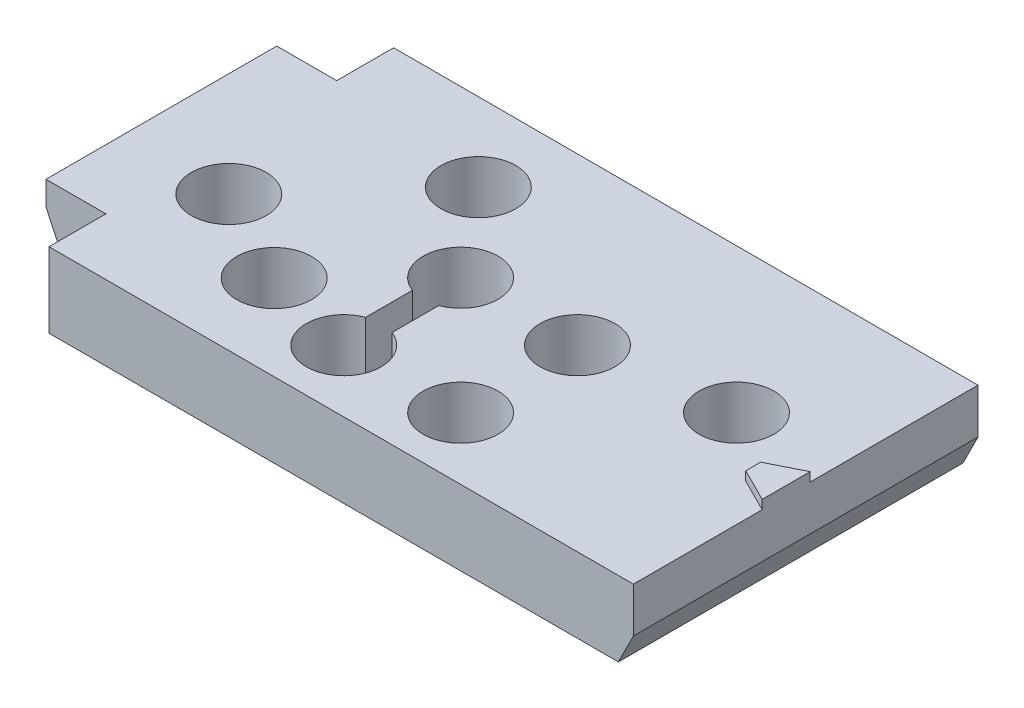
ISO-10303-21;
HEADER;
FILE_DESCRIPTION(('STEP AP214'),'2;1');
FILE_NAME('part.step','',(''),(''),'','','');
FILE_SCHEMA(('AUTOMOTIVE_DESIGN { 1 0 10303 214 1 1 1 1 }'));
ENDSEC;
DATA;
#1=APPLICATION_CONTEXT('core data for automotive mechanical design processes');
#2=APPLICATION_PROTOCOL_DEFINITION('international standard','automotive_design',2000,#1);
#3=PRODUCT_CONTEXT('',#1,'mechanical');
#4=PRODUCT('Part','Part','',(#3));
#5=PRODUCT_RELATED_PRODUCT_CATEGORY('part','',(#4));
#6=PRODUCT_DEFINITION_FORMATION('','',#4);
#7=PRODUCT_DEFINITION_CONTEXT('part definition',#1,'design');
#8=PRODUCT_DEFINITION('design','',#6,#7);
#9=PRODUCT_DEFINITION_SHAPE('','',#8);
#10=(LENGTH_UNIT() NAMED_UNIT(*) SI_UNIT(.MILLI.,.METRE.));
#11=(NAMED_UNIT(*) PLANE_ANGLE_UNIT() SI_UNIT($,.RADIAN.));
#12=(NAMED_UNIT(*) SI_UNIT($,.STERADIAN.) SOLID_ANGLE_UNIT());
#13=UNCERTAINTY_MEASURE_WITH_UNIT(LENGTH_MEASURE(1.E-05),#10,'distance_accuracy_value','');
#14=(GEOMETRIC_REPRESENTATION_CONTEXT(3) GLOBAL_UNCERTAINTY_ASSIGNED_CONTEXT((#13)) GLOBAL_UNIT_ASSIGNED_CONTEXT((#10,
#11,#12)) REPRESENTATION_CONTEXT('',''));
#15=CARTESIAN_POINT('',(0.,0.,0.));
#16=DIRECTION('',(0.,0.,1.));
#17=DIRECTION('',(1.,0.,0.));
#18=AXIS2_PLACEMENT_3D('',#15,#16,#17);
#19=CARTESIAN_POINT('',(23.2390769716936,-6.35,-43.157166812339));
#20=DIRECTION('',(-1.,0.,0.));
#21=DIRECTION('',(0.,0.,1.));
#22=AXIS2_PLACEMENT_3D('',#19,#20,#21);
#23=PLANE('',#22);
#24=DIRECTION('',(0.,0.,1.));
#25=VECTOR('',#24,1.);
#26=CARTESIAN_POINT('',(23.2390769716936,-2.032,-47.983306812339));
#27=LINE('',#26,#25);
#28=CARTESIAN_POINT('',(23.2390769716936,-2.032,-43.157166812339));
#29=VERTEX_POINT('',#28);
#30=CARTESIAN_POINT('',(23.2390769716936,-2.032,-23.599166812339));
#31=VERTEX_POINT('',#30);
#32=EDGE_CURVE('E167',#29,#31,#27,.T.);
#33=ORIENTED_EDGE('',*,*,#32,.T.);
#34=DIRECTION('',(0.,1.,0.));
#35=VECTOR('',#34,1.);
#36=CARTESIAN_POINT('',(23.2390769716936,-6.35,-23.599166812339));
#37=LINE('',#36,#35);
#38=CARTESIAN_POINT('',(23.2390769716936,0.,-23.599166812339));
#39=VERTEX_POINT('',#38);
#40=EDGE_CURVE('E166',#31,#39,#37,.T.);
#41=ORIENTED_EDGE('',*,*,#40,.T.);
#42=DIRECTION('',(0.,0.,1.));
#43=VECTOR('',#42,1.);
#44=CARTESIAN_POINT('',(23.2390769716936,0.,-43.157166812339));
#45=LINE('',#44,#43);
#46=CARTESIAN_POINT('',(23.2390769716936,0.,-43.157166812339));
#47=VERTEX_POINT('',#46);
#48=EDGE_CURVE('E192',#47,#39,#45,.T.);
#49=ORIENTED_EDGE('',*,*,#48,.F.);
#50=DIRECTION('',(0.,1.,0.));
#51=VECTOR('',#50,1.);
#52=CARTESIAN_POINT('',(23.2390769716936,-6.35,-43.157166812339));
#53=LINE('',#52,#51);
#54=EDGE_CURVE('E385',#29,#47,#53,.T.);
#55=ORIENTED_EDGE('',*,*,#54,.F.);
#56=EDGE_LOOP('',(#33,#41,#49,#55));
#57=FACE_BOUND('',#56,.T.);
#58=ADVANCED_FACE('F33',(#57),#23,.T.);
#59=CARTESIAN_POINT('',(23.2390769716936,-6.35,-43.157166812339));
#60=DIRECTION('',(0.,0.,1.));
#61=DIRECTION('',(1.,0.,0.));
#62=AXIS2_PLACEMENT_3D('',#59,#60,#61);
#63=PLANE('',#62);
#64=DIRECTION('',(1.,0.,0.));
#65=VECTOR('',#64,1.);
#66=CARTESIAN_POINT('',(23.2390769716936,-6.35,-43.157166812339));
#67=LINE('',#66,#65);
#68=CARTESIAN_POINT('',(25.2710769716936,-6.35,-43.157166812339));
#69=VERTEX_POINT('',#68);
#70=CARTESIAN_POINT('',(28.3190769716936,-6.35,-43.157166812339));
#71=VERTEX_POINT('',#70);
#72=EDGE_CURVE('E190',#69,#71,#67,.T.);
#73=ORIENTED_EDGE('',*,*,#72,.F.);
#74=DIRECTION('',(-0.425797036329879,0.904818702200994,0.));
#75=VECTOR('',#74,1.);
#76=CARTESIAN_POINT('',(24.9026690396823,-5.56713314447592,-43.157166812339));
#77=LINE('',#76,#75);
#78=EDGE_CURVE('E47',#69,#29,#77,.T.);
#79=ORIENTED_EDGE('',*,*,#78,.T.);
#80=ORIENTED_EDGE('',*,*,#54,.T.);
#81=DIRECTION('',(1.,0.,0.));
#82=VECTOR('',#81,1.);
#83=CARTESIAN_POINT('',(23.2390769716936,0.,-43.157166812339));
#84=LINE('',#83,#82);
#85=CARTESIAN_POINT('',(28.3190769716936,0.,-43.157166812339));
#86=VERTEX_POINT('',#85);
#87=EDGE_CURVE('E173',#47,#86,#84,.T.);
#88=ORIENTED_EDGE('',*,*,#87,.T.);
#89=DIRECTION('',(0.,1.,0.));
#90=VECTOR('',#89,1.);
#91=CARTESIAN_POINT('',(28.3190769716936,-6.35,-43.157166812339));
#92=LINE('',#91,#90);
#93=EDGE_CURVE('E413',#71,#86,#92,.T.);
#94=ORIENTED_EDGE('',*,*,#93,.F.);
#95=EDGE_LOOP('',(#73,#79,#80,#88,#94));
#96=FACE_BOUND('',#95,.T.);
#97=ADVANCED_FACE('F374',(#96),#63,.F.);
#98=CARTESIAN_POINT('',(28.3190769716936,-6.35,-47.983166812339));
#99=DIRECTION('',(-1.,0.,0.));
#100=DIRECTION('',(0.,0.,1.));
#101=AXIS2_PLACEMENT_3D('',#98,#99,#100);
#102=PLANE('',#101);
#103=DIRECTION('',(0.,0.,1.));
#104=VECTOR('',#103,1.);
#105=CARTESIAN_POINT('',(28.3190769716936,0.,-47.983166812339));
#106=LINE('',#105,#104);
#107=CARTESIAN_POINT('',(28.3190769716936,0.,-47.983166812339));
#108=VERTEX_POINT('',#107);
#109=EDGE_CURVE('E178',#108,#86,#106,.T.);
#110=ORIENTED_EDGE('',*,*,#109,.F.);
#111=DIRECTION('',(0.,1.,0.));
#112=VECTOR('',#111,1.);
#113=CARTESIAN_POINT('',(28.3190769716936,-6.35,-47.983166812339));
#114=LINE('',#113,#112);
#115=CARTESIAN_POINT('',(28.3190769716936,-6.35,-47.983166812339));
#116=VERTEX_POINT('',#115);
#117=EDGE_CURVE('E227',#116,#108,#114,.T.);
#118=ORIENTED_EDGE('',*,*,#117,.F.);
#119=DIRECTION('',(0.,0.,1.));
#120=VECTOR('',#119,1.);
#121=CARTESIAN_POINT('',(28.3190769716936,-6.35,-47.983166812339));
#122=LINE('',#121,#120);
#123=EDGE_CURVE('E187',#116,#71,#122,.T.);
#124=ORIENTED_EDGE('',*,*,#123,.T.);
#125=ORIENTED_EDGE('',*,*,#93,.T.);
#126=EDGE_LOOP('',(#110,#118,#124,#125));
#127=FACE_BOUND('',#126,.T.);
#128=ADVANCED_FACE('F380',(#127),#102,.T.);
#129=CARTESIAN_POINT('',(77.8490769716936,-6.35,-47.983166812339));
#130=DIRECTION('',(0.,0.,-1.));
#131=DIRECTION('',(-1.,0.,0.));
#132=AXIS2_PLACEMENT_3D('',#129,#130,#131);
#133=PLANE('',#132);
#134=DIRECTION('',(0.447213595499956,0.894427190999917,0.));
#135=VECTOR('',#134,1.);
#136=CARTESIAN_POINT('',(76.8330769716936,-5.84200000000001,-47.983166812339));
#137=LINE('',#136,#135);
#138=CARTESIAN_POINT('',(76.5790769716936,-6.35,-47.983166812339));
#139=VERTEX_POINT('',#138);
#140=CARTESIAN_POINT('',(77.8490769716936,-3.81000000000001,-47.983169312339));
#141=VERTEX_POINT('',#140);
#142=EDGE_CURVE('E234',#139,#141,#137,.T.);
#143=ORIENTED_EDGE('',*,*,#142,.F.);
#144=DIRECTION('',(-1.,0.,0.));
#145=VECTOR('',#144,1.);
#146=CARTESIAN_POINT('',(77.8490769716936,-6.35,-47.983166812339));
#147=LINE('',#146,#145);
#148=EDGE_CURVE('E185',#139,#116,#147,.T.);
#149=ORIENTED_EDGE('',*,*,#148,.T.);
#150=ORIENTED_EDGE('',*,*,#117,.T.);
#151=DIRECTION('',(-1.,0.,0.));
#152=VECTOR('',#151,1.);
#153=CARTESIAN_POINT('',(77.8490769716936,0.,-47.983166812339));
#154=LINE('',#153,#152);
#155=CARTESIAN_POINT('',(77.8490769716936,0.,-47.983166812339));
#156=VERTEX_POINT('',#155);
#157=EDGE_CURVE('E208',#156,#108,#154,.T.);
#158=ORIENTED_EDGE('',*,*,#157,.F.);
#159=DIRECTION('',(0.,1.,0.));
#160=VECTOR('',#159,1.);
#161=CARTESIAN_POINT('',(77.8490769716936,-6.35,-47.983166812339));
#162=LINE('',#161,#160);
#163=EDGE_CURVE('E224',#141,#156,#162,.T.);
#164=ORIENTED_EDGE('',*,*,#163,.F.);
#165=EDGE_LOOP('',(#143,#149,#150,#158,#164));
#166=FACE_BOUND('',#165,.T.);
#167=ADVANCED_FACE('F418',(#166),#133,.T.);
#168=CARTESIAN_POINT('',(77.8490769716936,-6.35,-47.983166812339));
#169=DIRECTION('',(-1.,0.,0.));
#170=DIRECTION('',(0.,0.,1.));
#171=AXIS2_PLACEMENT_3D('',#168,#169,#170);
#172=PLANE('',#171);
#173=DIRECTION('',(0.,1.,0.));
#174=VECTOR('',#173,1.);
#175=CARTESIAN_POINT('',(77.8490769716936,-6.35,-18.773166812339));
#176=LINE('',#175,#174);
#177=CARTESIAN_POINT('',(77.8490769716936,-3.81,-18.773166812339));
#178=VERTEX_POINT('',#177);
#179=CARTESIAN_POINT('',(77.8490769716936,0.,-18.773166812339));
#180=VERTEX_POINT('',#179);
#181=EDGE_CURVE('E222',#178,#180,#176,.T.);
#182=ORIENTED_EDGE('',*,*,#181,.F.);
#183=DIRECTION('',(0.,0.,1.));
#184=VECTOR('',#183,1.);
#185=CARTESIAN_POINT('',(77.8490769716936,-3.81,-47.983191812339));
#186=LINE('',#185,#184);
#187=EDGE_CURVE('E238',#141,#178,#186,.T.);
#188=ORIENTED_EDGE('',*,*,#187,.F.);
#189=ORIENTED_EDGE('',*,*,#163,.T.);
#190=DIRECTION('',(0.,0.,1.));
#191=VECTOR('',#190,1.);
#192=CARTESIAN_POINT('',(77.8490769716936,0.,-47.983166812339));
#193=LINE('',#192,#191);
#194=CARTESIAN_POINT('',(77.8490769716936,0.,-33.759166812339));
#195=VERTEX_POINT('',#194);
#196=EDGE_CURVE('E214',#156,#195,#193,.T.);
#197=ORIENTED_EDGE('',*,*,#196,.T.);
#198=DIRECTION('',(0.,-1.,0.));
#199=VECTOR('',#198,1.);
#200=CARTESIAN_POINT('',(77.8490769716936,0.762,-33.759166812339));
#201=LINE('',#200,#199);
#202=CARTESIAN_POINT('',(77.8490769716936,0.762,-33.759166812339));
#203=VERTEX_POINT('',#202);
#204=EDGE_CURVE('E749',#203,#195,#201,.T.);
#205=ORIENTED_EDGE('',*,*,#204,.F.);
#206=DIRECTION('',(0.,0.,-1.));
#207=VECTOR('',#206,1.);
#208=CARTESIAN_POINT('',(77.8490769716936,0.762,-33.759166812339));
#209=LINE('',#208,#207);
#210=CARTESIAN_POINT('',(77.8490769716936,0.762,-29.695166812339));
#211=VERTEX_POINT('',#210);
#212=EDGE_CURVE('E248',#211,#203,#209,.T.);
#213=ORIENTED_EDGE('',*,*,#212,.F.);
#214=DIRECTION('',(0.,-1.,0.));
#215=VECTOR('',#214,1.);
#216=CARTESIAN_POINT('',(77.8490769716936,0.762,-29.695166812339));
#217=LINE('',#216,#215);
#218=CARTESIAN_POINT('',(77.8490769716936,0.,-29.695166812339));
#219=VERTEX_POINT('',#218);
#220=EDGE_CURVE('E258',#211,#219,#217,.T.);
#221=ORIENTED_EDGE('',*,*,#220,.T.);
#222=EDGE_CURVE('E205',#219,#180,#193,.T.);
#223=ORIENTED_EDGE('',*,*,#222,.T.);
#224=EDGE_LOOP('',(#182,#188,#189,#197,#205,#213,#221,#223));
#225=FACE_BOUND('',#224,.T.);
#226=ADVANCED_FACE('F400',(#225),#172,.F.);
#227=CARTESIAN_POINT('',(77.8490769716936,-6.35,-18.773166812339));
#228=DIRECTION('',(0.,0.,-1.));
#229=DIRECTION('',(-1.,0.,0.));
#230=AXIS2_PLACEMENT_3D('',#227,#228,#229);
#231=PLANE('',#230);
#232=DIRECTION('',(-1.,0.,0.));
#233=VECTOR('',#232,1.);
#234=CARTESIAN_POINT('',(77.8490769716936,-6.35,-18.773166812339));
#235=LINE('',#234,#233);
#236=CARTESIAN_POINT('',(76.5790769716936,-6.35,-18.773166812339));
#237=VERTEX_POINT('',#236);
#238=CARTESIAN_POINT('',(28.3190769716936,-6.35,-18.773166812339));
#239=VERTEX_POINT('',#238);
#240=EDGE_CURVE('E175',#237,#239,#235,.T.);
#241=ORIENTED_EDGE('',*,*,#240,.F.);
#242=DIRECTION('',(-0.447213595499956,-0.894427190999917,0.));
#243=VECTOR('',#242,1.);
#244=CARTESIAN_POINT('',(77.8490769716936,-3.81,-18.773166812339));
#245=LINE('',#244,#243);
#246=EDGE_CURVE('E54',#178,#237,#245,.T.);
#247=ORIENTED_EDGE('',*,*,#246,.F.);
#248=ORIENTED_EDGE('',*,*,#181,.T.);
#249=DIRECTION('',(-1.,0.,0.));
#250=VECTOR('',#249,1.);
#251=CARTESIAN_POINT('',(77.8490769716936,0.,-18.773166812339));
#252=LINE('',#251,#250);
#253=CARTESIAN_POINT('',(28.3190769716936,0.,-18.773166812339));
#254=VERTEX_POINT('',#253);
#255=EDGE_CURVE('E202',#180,#254,#252,.T.);
#256=ORIENTED_EDGE('',*,*,#255,.T.);
#257=DIRECTION('',(0.,1.,0.));
#258=VECTOR('',#257,1.);
#259=CARTESIAN_POINT('',(28.3190769716936,-6.35,-18.773166812339));
#260=LINE('',#259,#258);
#261=EDGE_CURVE('E220',#239,#254,#260,.T.);
#262=ORIENTED_EDGE('',*,*,#261,.F.);
#263=EDGE_LOOP('',(#241,#247,#248,#256,#262));
#264=FACE_BOUND('',#263,.T.);
#265=ADVANCED_FACE('F397',(#264),#231,.F.);
#266=CARTESIAN_POINT('',(28.3190769716936,-6.35,-23.599166812339));
#267=DIRECTION('',(-1.,0.,0.));
#268=DIRECTION('',(0.,0.,1.));
#269=AXIS2_PLACEMENT_3D('',#266,#267,#268);
#270=PLANE('',#269);
#271=DIRECTION('',(0.,0.,1.));
#272=VECTOR('',#271,1.);
#273=CARTESIAN_POINT('',(28.3190769716936,0.,-23.599166812339));
#274=LINE('',#273,#272);
#275=CARTESIAN_POINT('',(28.3190769716936,0.,-23.599166812339));
#276=VERTEX_POINT('',#275);
#277=EDGE_CURVE('E199',#276,#254,#274,.T.);
#278=ORIENTED_EDGE('',*,*,#277,.F.);
#279=DIRECTION('',(0.,1.,0.));
#280=VECTOR('',#279,1.);
#281=CARTESIAN_POINT('',(28.3190769716936,-6.35,-23.599166812339));
#282=LINE('',#281,#280);
#283=CARTESIAN_POINT('',(28.3190769716936,-6.35,-23.599166812339));
#284=VERTEX_POINT('',#283);
#285=EDGE_CURVE('E218',#284,#276,#282,.T.);
#286=ORIENTED_EDGE('',*,*,#285,.F.);
#287=DIRECTION('',(0.,0.,1.));
#288=VECTOR('',#287,1.);
#289=CARTESIAN_POINT('',(28.3190769716936,-6.35,-23.599166812339));
#290=LINE('',#289,#288);
#291=EDGE_CURVE('E172',#284,#239,#290,.T.);
#292=ORIENTED_EDGE('',*,*,#291,.T.);
#293=ORIENTED_EDGE('',*,*,#261,.T.);
#294=EDGE_LOOP('',(#278,#286,#292,#293));
#295=FACE_BOUND('',#294,.T.);
#296=ADVANCED_FACE('F407',(#295),#270,.T.);
#297=CARTESIAN_POINT('',(23.2390769716936,-6.35,-23.599166812339));
#298=DIRECTION('',(0.,0.,1.));
#299=DIRECTION('',(1.,0.,0.));
#300=AXIS2_PLACEMENT_3D('',#297,#298,#299);
#301=PLANE('',#300);
#302=DIRECTION('',(-0.425797036329879,0.904818702200994,0.));
#303=VECTOR('',#302,1.);
#304=CARTESIAN_POINT('',(25.2710769716936,-6.35,-23.599166812339));
#305=LINE('',#304,#303);
#306=CARTESIAN_POINT('',(25.2710769716936,-6.35,-23.599166812339));
#307=VERTEX_POINT('',#306);
#308=EDGE_CURVE('E155',#307,#31,#305,.T.);
#309=ORIENTED_EDGE('',*,*,#308,.F.);
#310=DIRECTION('',(1.,0.,0.));
#311=VECTOR('',#310,1.);
#312=CARTESIAN_POINT('',(23.2390769716936,-6.35,-23.599166812339));
#313=LINE('',#312,#311);
#314=EDGE_CURVE('E163',#307,#284,#313,.T.);
#315=ORIENTED_EDGE('',*,*,#314,.T.);
#316=ORIENTED_EDGE('',*,*,#285,.T.);
#317=DIRECTION('',(1.,0.,0.));
#318=VECTOR('',#317,1.);
#319=CARTESIAN_POINT('',(23.2390769716936,0.,-23.599166812339));
#320=LINE('',#319,#318);
#321=EDGE_CURVE('E195',#39,#276,#320,.T.);
#322=ORIENTED_EDGE('',*,*,#321,.F.);
#323=ORIENTED_EDGE('',*,*,#40,.F.);
#324=EDGE_LOOP('',(#309,#315,#316,#322,#323));
#325=FACE_BOUND('',#324,.T.);
#326=ADVANCED_FACE('F162',(#325),#301,.T.);
#327=CARTESIAN_POINT('',(0.,-6.35,0.));
#328=DIRECTION('',(0.,1.,0.));
#329=DIRECTION('',(0.,0.,1.));
#330=AXIS2_PLACEMENT_3D('',#327,#328,#329);
#331=PLANE('',#330);
#332=CARTESIAN_POINT('',(40.1617907848717,-6.35,-26.0145965120273));
#333=DIRECTION('',(0.,1.,0.));
#334=DIRECTION('',(0.,0.,1.));
#335=AXIS2_PLACEMENT_3D('',#332,#333,#334);
#336=CIRCLE('',#335,1.016);
#337=CARTESIAN_POINT('',(40.1617907848717,-6.35,-24.9985965120273));
#338=VERTEX_POINT('',#337);
#339=EDGE_CURVE('E237',#338,#338,#336,.T.);
#340=ORIENTED_EDGE('',*,*,#339,.T.);
#341=EDGE_LOOP('',(#340));
#342=FACE_BOUND('',#341,.T.);
#343=CARTESIAN_POINT('',(69.6313053546618,-6.35,-35.7317660343621));
#344=DIRECTION('',(0.,1.,0.));
#345=DIRECTION('',(0.,0.,1.));
#346=AXIS2_PLACEMENT_3D('',#343,#344,#345);
#347=CIRCLE('',#346,1.016);
#348=CARTESIAN_POINT('',(69.6313053546618,-6.35,-34.7157660343621));
#349=VERTEX_POINT('',#348);
#350=EDGE_CURVE('E244',#349,#349,#347,.T.);
#351=ORIENTED_EDGE('',*,*,#350,.T.);
#352=EDGE_LOOP('',(#351));
#353=FACE_BOUND('',#352,.T.);
#354=ORIENTED_EDGE('',*,*,#314,.F.);
#355=DIRECTION('',(0.,0.,-1.));
#356=VECTOR('',#355,1.);
#357=CARTESIAN_POINT('',(25.2710769716936,-6.35,0.));
#358=LINE('',#357,#356);
#359=EDGE_CURVE('E11',#307,#69,#358,.T.);
#360=ORIENTED_EDGE('',*,*,#359,.T.);
#361=ORIENTED_EDGE('',*,*,#72,.T.);
#362=ORIENTED_EDGE('',*,*,#123,.F.);
#363=ORIENTED_EDGE('',*,*,#148,.F.);
#364=DIRECTION('',(0.,0.,1.));
#365=VECTOR('',#364,1.);
#366=CARTESIAN_POINT('',(76.5790769716936,-6.35,0.));
#367=LINE('',#366,#365);
#368=EDGE_CURVE('E40',#139,#237,#367,.T.);
#369=ORIENTED_EDGE('',*,*,#368,.T.);
#370=ORIENTED_EDGE('',*,*,#240,.T.);
#371=ORIENTED_EDGE('',*,*,#291,.F.);
#372=EDGE_LOOP('',(#354,#360,#361,#362,#363,#369,#370,#371));
#373=FACE_BOUND('',#372,.T.);
#374=ADVANCED_FACE('F170',(#342,#353,#373),#331,.F.);
#375=CARTESIAN_POINT('',(0.,0.,0.));
#376=DIRECTION('',(0.,1.,0.));
#377=DIRECTION('',(0.,0.,1.));
#378=AXIS2_PLACEMENT_3D('',#375,#376,#377);
#379=PLANE('',#378);
#380=DIRECTION('',(0.894427190999915,0.,0.447213595499959));
#381=VECTOR('',#380,1.);
#382=CARTESIAN_POINT('',(75.0550769716936,0.,-31.092166812339));
#383=LINE('',#382,#381);
#384=CARTESIAN_POINT('',(75.0550769716936,0.,-31.092166812339));
#385=VERTEX_POINT('',#384);
#386=EDGE_CURVE('E252',#385,#219,#383,.T.);
#387=ORIENTED_EDGE('',*,*,#386,.F.);
#388=DIRECTION('',(0.,0.,1.));
#389=VECTOR('',#388,1.);
#390=CARTESIAN_POINT('',(75.0550769716936,0.,-32.362166812339));
#391=LINE('',#390,#389);
#392=CARTESIAN_POINT('',(75.0550769716936,0.,-32.362166812339));
#393=VERTEX_POINT('',#392);
#394=EDGE_CURVE('E259',#393,#385,#391,.T.);
#395=ORIENTED_EDGE('',*,*,#394,.F.);
#396=DIRECTION('',(-0.894427190999916,0.,0.447213595499958));
#397=VECTOR('',#396,1.);
#398=CARTESIAN_POINT('',(77.8490769716936,0.,-33.759166812339));
#399=LINE('',#398,#397);
#400=EDGE_CURVE('E262',#195,#393,#399,.T.);
#401=ORIENTED_EDGE('',*,*,#400,.F.);
#402=ORIENTED_EDGE('',*,*,#196,.F.);
#403=ORIENTED_EDGE('',*,*,#157,.T.);
#404=ORIENTED_EDGE('',*,*,#109,.T.);
#405=ORIENTED_EDGE('',*,*,#87,.F.);
#406=ORIENTED_EDGE('',*,*,#48,.T.);
#407=ORIENTED_EDGE('',*,*,#321,.T.);
#408=ORIENTED_EDGE('',*,*,#277,.T.);
#409=ORIENTED_EDGE('',*,*,#255,.F.);
#410=ORIENTED_EDGE('',*,*,#222,.F.);
#411=EDGE_LOOP('',(#387,#395,#401,#402,#403,#404,#405,#406,#407,#408,#409,#410));
#412=FACE_BOUND('',#411,.T.);
#413=CARTESIAN_POINT('',(69.6313053546618,0.,-35.7317660343621));
#414=DIRECTION('',(0.,1.,0.));
#415=DIRECTION('',(0.,0.,1.));
#416=AXIS2_PLACEMENT_3D('',#413,#414,#415);
#417=CIRCLE('',#416,3.175);
#418=CARTESIAN_POINT('',(69.6313053546618,0.,-32.5567660343621));
#419=VERTEX_POINT('',#418);
#420=EDGE_CURVE('E746',#419,#419,#417,.T.);
#421=ORIENTED_EDGE('',*,*,#420,.F.);
#422=EDGE_LOOP('',(#421));
#423=FACE_BOUND('',#422,.T.);
#424=CARTESIAN_POINT('',(57.943162235797,0.,-24.0364851627978));
#425=DIRECTION('',(0.,1.,0.));
#426=DIRECTION('',(0.,0.,1.));
#427=AXIS2_PLACEMENT_3D('',#424,#425,#426);
#428=CIRCLE('',#427,3.175);
#429=CARTESIAN_POINT('',(57.943162235797,0.,-20.8614851627978));
#430=VERTEX_POINT('',#429);
#431=EDGE_CURVE('E739',#430,#430,#428,.T.);
#432=ORIENTED_EDGE('',*,*,#431,.F.);
#433=EDGE_LOOP('',(#432));
#434=FACE_BOUND('',#433,.T.);
#435=CARTESIAN_POINT('',(57.943162235797,0.,-33.9424851627978));
#436=DIRECTION('',(0.,1.,0.));
#437=DIRECTION('',(0.,0.,1.));
#438=AXIS2_PLACEMENT_3D('',#435,#436,#437);
#439=CIRCLE('',#438,3.17500000000001);
#440=CARTESIAN_POINT('',(57.943162235797,0.,-30.7674851627978));
#441=VERTEX_POINT('',#440);
#442=EDGE_CURVE('E304',#441,#441,#439,.T.);
#443=ORIENTED_EDGE('',*,*,#442,.F.);
#444=EDGE_LOOP('',(#443));
#445=FACE_BOUND('',#444,.T.);
#446=CARTESIAN_POINT('',(40.1617907848717,0.,-26.0145965120273));
#447=DIRECTION('',(0.,1.,0.));
#448=DIRECTION('',(0.,0.,1.));
#449=AXIS2_PLACEMENT_3D('',#446,#447,#448);
#450=CIRCLE('',#449,3.175);
#451=CARTESIAN_POINT('',(40.1617907848717,0.,-22.8395965120273));
#452=VERTEX_POINT('',#451);
#453=EDGE_CURVE('E295',#452,#452,#450,.T.);
#454=ORIENTED_EDGE('',*,*,#453,.F.);
#455=EDGE_LOOP('',(#454));
#456=FACE_BOUND('',#455,.T.);
#457=CARTESIAN_POINT('',(32.0692189621016,0.,-30.2631116989258));
#458=DIRECTION('',(0.,1.,0.));
#459=DIRECTION('',(0.,0.,1.));
#460=AXIS2_PLACEMENT_3D('',#457,#458,#459);
#461=CIRCLE('',#460,3.175);
#462=CARTESIAN_POINT('',(32.0692189621016,0.,-27.0881116989258));
#463=VERTEX_POINT('',#462);
#464=EDGE_CURVE('E294',#463,#463,#461,.T.);
#465=ORIENTED_EDGE('',*,*,#464,.F.);
#466=EDGE_LOOP('',(#465));
#467=FACE_BOUND('',#466,.T.);
#468=CARTESIAN_POINT('',(42.1430847505862,0.,-41.3424240196145));
#469=DIRECTION('',(0.,1.,0.));
#470=DIRECTION('',(0.,0.,1.));
#471=AXIS2_PLACEMENT_3D('',#468,#469,#470);
#472=CIRCLE('',#471,3.175);
#473=CARTESIAN_POINT('',(42.1430847505862,0.,-38.1674240196145));
#474=VERTEX_POINT('',#473);
#475=EDGE_CURVE('E308',#474,#474,#472,.T.);
#476=ORIENTED_EDGE('',*,*,#475,.F.);
#477=EDGE_LOOP('',(#476));
#478=FACE_BOUND('',#477,.T.);
#479=CARTESIAN_POINT('',(48.037162235797,0.,-33.9424851627978));
#480=DIRECTION('',(0.,1.,0.));
#481=DIRECTION('',(0.,0.,1.));
#482=AXIS2_PLACEMENT_3D('',#479,#480,#481);
#483=CIRCLE('',#482,3.175);
#484=CARTESIAN_POINT('',(49.154762235797,0.,-30.9706851627978));
#485=VERTEX_POINT('',#484);
#486=CARTESIAN_POINT('',(46.919562235797,0.,-30.9706851627978));
#487=VERTEX_POINT('',#486);
#488=EDGE_CURVE('E313',#485,#487,#483,.T.);
#489=ORIENTED_EDGE('',*,*,#488,.F.);
#490=DIRECTION('',(0.,0.,-1.));
#491=VECTOR('',#490,1.);
#492=CARTESIAN_POINT('',(49.154762235797,0.,-27.0082851627978));
#493=LINE('',#492,#491);
#494=CARTESIAN_POINT('',(49.154762235797,0.,-27.0082851627978));
#495=VERTEX_POINT('',#494);
#496=EDGE_CURVE('E320',#495,#485,#493,.T.);
#497=ORIENTED_EDGE('',*,*,#496,.F.);
#498=CARTESIAN_POINT('',(48.037162235797,0.,-24.0364851627978));
#499=DIRECTION('',(0.,1.,0.));
#500=DIRECTION('',(0.,0.,1.));
#501=AXIS2_PLACEMENT_3D('',#498,#499,#500);
#502=CIRCLE('',#501,3.175);
#503=CARTESIAN_POINT('',(46.919562235797,0.,-27.0082851627978));
#504=VERTEX_POINT('',#503);
#505=EDGE_CURVE('E333',#504,#495,#502,.T.);
#506=ORIENTED_EDGE('',*,*,#505,.F.);
#507=DIRECTION('',(0.,0.,1.));
#508=VECTOR('',#507,1.);
#509=CARTESIAN_POINT('',(46.919562235797,0.,-30.9706851627978));
#510=LINE('',#509,#508);
#511=EDGE_CURVE('E330',#487,#504,#510,.T.);
#512=ORIENTED_EDGE('',*,*,#511,.F.);
#513=EDGE_LOOP('',(#489,#497,#506,#512));
#514=FACE_BOUND('',#513,.T.);
#515=ADVANCED_FACE('F353',(#412,#423,#434,#445,#456,#467,#478,#514),#379,.T.);
#516=CARTESIAN_POINT('',(48.037162235797,-5.588,-33.9424851627978));
#517=DIRECTION('',(0.,1.,0.));
#518=DIRECTION('',(0.,0.,1.));
#519=AXIS2_PLACEMENT_3D('',#516,#517,#518);
#520=CYLINDRICAL_SURFACE('',#519,3.175);
#521=ORIENTED_EDGE('',*,*,#488,.T.);
#522=DIRECTION('',(0.,1.,0.));
#523=VECTOR('',#522,1.);
#524=CARTESIAN_POINT('',(46.919562235797,-5.588,-30.9706851627978));
#525=LINE('',#524,#523);
#526=CARTESIAN_POINT('',(46.919562235797,-5.588,-30.9706851627978));
#527=VERTEX_POINT('',#526);
#528=EDGE_CURVE('E181',#527,#487,#525,.T.);
#529=ORIENTED_EDGE('',*,*,#528,.F.);
#530=CARTESIAN_POINT('',(48.037162235797,-5.588,-33.9424851627978));
#531=DIRECTION('',(0.,1.,0.));
#532=DIRECTION('',(0.,0.,1.));
#533=AXIS2_PLACEMENT_3D('',#530,#531,#532);
#534=CIRCLE('',#533,3.175);
#535=CARTESIAN_POINT('',(49.154762235797,-5.588,-30.9706851627978));
#536=VERTEX_POINT('',#535);
#537=EDGE_CURVE('E316',#536,#527,#534,.T.);
#538=ORIENTED_EDGE('',*,*,#537,.F.);
#539=DIRECTION('',(0.,1.,0.));
#540=VECTOR('',#539,1.);
#541=CARTESIAN_POINT('',(49.154762235797,-5.588,-30.9706851627978));
#542=LINE('',#541,#540);
#543=EDGE_CURVE('E196',#536,#485,#542,.T.);
#544=ORIENTED_EDGE('',*,*,#543,.T.);
#545=EDGE_LOOP('',(#521,#529,#538,#544));
#546=FACE_BOUND('',#545,.T.);
#547=ADVANCED_FACE('F361',(#546),#520,.F.);
#548=CARTESIAN_POINT('',(49.154762235797,-5.588,-27.0082851627978));
#549=DIRECTION('',(1.,0.,0.));
#550=DIRECTION('',(0.,0.,-1.));
#551=AXIS2_PLACEMENT_3D('',#548,#549,#550);
#552=PLANE('',#551);
#553=ORIENTED_EDGE('',*,*,#496,.T.);
#554=ORIENTED_EDGE('',*,*,#543,.F.);
#555=DIRECTION('',(0.,0.,-1.));
#556=VECTOR('',#555,1.);
#557=CARTESIAN_POINT('',(49.154762235797,-5.588,-27.0082851627978));
#558=LINE('',#557,#556);
#559=CARTESIAN_POINT('',(49.154762235797,-5.588,-27.0082851627978));
#560=VERTEX_POINT('',#559);
#561=EDGE_CURVE('E326',#560,#536,#558,.T.);
#562=ORIENTED_EDGE('',*,*,#561,.F.);
#563=DIRECTION('',(0.,1.,0.));
#564=VECTOR('',#563,1.);
#565=CARTESIAN_POINT('',(49.154762235797,-5.588,-27.0082851627978));
#566=LINE('',#565,#564);
#567=EDGE_CURVE('E339',#560,#495,#566,.T.);
#568=ORIENTED_EDGE('',*,*,#567,.T.);
#569=EDGE_LOOP('',(#553,#554,#562,#568));
#570=FACE_BOUND('',#569,.T.);
#571=ADVANCED_FACE('F360',(#570),#552,.F.);
#572=CARTESIAN_POINT('',(48.037162235797,-5.588,-24.0364851627978));
#573=DIRECTION('',(0.,1.,0.));
#574=DIRECTION('',(0.,0.,1.));
#575=AXIS2_PLACEMENT_3D('',#572,#573,#574);
#576=CYLINDRICAL_SURFACE('',#575,3.175);
#577=ORIENTED_EDGE('',*,*,#505,.T.);
#578=ORIENTED_EDGE('',*,*,#567,.F.);
#579=CARTESIAN_POINT('',(48.037162235797,-5.588,-24.0364851627978));
#580=DIRECTION('',(0.,1.,0.));
#581=DIRECTION('',(0.,0.,1.));
#582=AXIS2_PLACEMENT_3D('',#579,#580,#581);
#583=CIRCLE('',#582,3.175);
#584=CARTESIAN_POINT('',(46.919562235797,-5.588,-27.0082851627978));
#585=VERTEX_POINT('',#584);
#586=EDGE_CURVE('E323',#585,#560,#583,.T.);
#587=ORIENTED_EDGE('',*,*,#586,.F.);
#588=DIRECTION('',(0.,1.,0.));
#589=VECTOR('',#588,1.);
#590=CARTESIAN_POINT('',(46.919562235797,-5.588,-27.0082851627978));
#591=LINE('',#590,#589);
#592=EDGE_CURVE('E340',#585,#504,#591,.T.);
#593=ORIENTED_EDGE('',*,*,#592,.T.);
#594=EDGE_LOOP('',(#577,#578,#587,#593));
#595=FACE_BOUND('',#594,.T.);
#596=ADVANCED_FACE('F355',(#595),#576,.F.);
#597=CARTESIAN_POINT('',(46.919562235797,-5.588,-30.9706851627978));
#598=DIRECTION('',(-1.,0.,0.));
#599=DIRECTION('',(0.,0.,1.));
#600=AXIS2_PLACEMENT_3D('',#597,#598,#599);
#601=PLANE('',#600);
#602=ORIENTED_EDGE('',*,*,#511,.T.);
#603=ORIENTED_EDGE('',*,*,#592,.F.);
#604=DIRECTION('',(0.,0.,1.));
#605=VECTOR('',#604,1.);
#606=CARTESIAN_POINT('',(46.919562235797,-5.588,-30.9706851627978));
#607=LINE('',#606,#605);
#608=EDGE_CURVE('E319',#527,#585,#607,.T.);
#609=ORIENTED_EDGE('',*,*,#608,.F.);
#610=ORIENTED_EDGE('',*,*,#528,.T.);
#611=EDGE_LOOP('',(#602,#603,#609,#610));
#612=FACE_BOUND('',#611,.T.);
#613=ADVANCED_FACE('F347',(#612),#601,.F.);
#614=CARTESIAN_POINT('',(48.037162235797,-5.588,-33.9424851627978));
#615=DIRECTION('',(0.,1.,0.));
#616=DIRECTION('',(0.,0.,1.));
#617=AXIS2_PLACEMENT_3D('',#614,#615,#616);
#618=PLANE('',#617);
#619=ORIENTED_EDGE('',*,*,#537,.T.);
#620=ORIENTED_EDGE('',*,*,#608,.T.);
#621=ORIENTED_EDGE('',*,*,#586,.T.);
#622=ORIENTED_EDGE('',*,*,#561,.T.);
#623=EDGE_LOOP('',(#619,#620,#621,#622));
#624=FACE_BOUND('',#623,.T.);
#625=ADVANCED_FACE('F359',(#624),#618,.T.);
#626=CARTESIAN_POINT('',(42.1430847505862,-5.588,-41.3424240196145));
#627=DIRECTION('',(0.,1.,0.));
#628=DIRECTION('',(0.,0.,1.));
#629=AXIS2_PLACEMENT_3D('',#626,#627,#628);
#630=CYLINDRICAL_SURFACE('',#629,3.175);
#631=CARTESIAN_POINT('',(42.1430847505862,-5.588,-41.3424240196145));
#632=DIRECTION('',(0.,1.,0.));
#633=DIRECTION('',(0.,0.,1.));
#634=AXIS2_PLACEMENT_3D('',#631,#632,#633);
#635=CIRCLE('',#634,3.175);
#636=CARTESIAN_POINT('',(42.1430847505862,-5.588,-38.1674240196145));
#637=VERTEX_POINT('',#636);
#638=EDGE_CURVE('E310',#637,#637,#635,.T.);
#639=ORIENTED_EDGE('',*,*,#638,.F.);
#640=EDGE_LOOP('',(#639));
#641=FACE_BOUND('',#640,.T.);
#642=ORIENTED_EDGE('',*,*,#475,.T.);
#643=EDGE_LOOP('',(#642));
#644=FACE_BOUND('',#643,.T.);
#645=ADVANCED_FACE('F510',(#641,#644),#630,.F.);
#646=CARTESIAN_POINT('',(42.1430847505862,-5.588,-41.3424240196145));
#647=DIRECTION('',(0.,1.,0.));
#648=DIRECTION('',(0.,0.,1.));
#649=AXIS2_PLACEMENT_3D('',#646,#647,#648);
#650=PLANE('',#649);
#651=ORIENTED_EDGE('',*,*,#638,.T.);
#652=EDGE_LOOP('',(#651));
#653=FACE_BOUND('',#652,.T.);
#654=ADVANCED_FACE('F506',(#653),#650,.T.);
#655=CARTESIAN_POINT('',(32.0692189621016,-5.588,-30.2631116989258));
#656=DIRECTION('',(0.,1.,0.));
#657=DIRECTION('',(0.,0.,1.));
#658=AXIS2_PLACEMENT_3D('',#655,#656,#657);
#659=CYLINDRICAL_SURFACE('',#658,3.175);
#660=CARTESIAN_POINT('',(32.0692189621016,-5.588,-30.2631116989258));
#661=DIRECTION('',(0.,1.,0.));
#662=DIRECTION('',(0.,0.,1.));
#663=AXIS2_PLACEMENT_3D('',#660,#661,#662);
#664=CIRCLE('',#663,3.175);
#665=CARTESIAN_POINT('',(32.0692189621016,-5.588,-27.0881116989258));
#666=VERTEX_POINT('',#665);
#667=EDGE_CURVE('E298',#666,#666,#664,.T.);
#668=ORIENTED_EDGE('',*,*,#667,.F.);
#669=EDGE_LOOP('',(#668));
#670=FACE_BOUND('',#669,.T.);
#671=ORIENTED_EDGE('',*,*,#464,.T.);
#672=EDGE_LOOP('',(#671));
#673=FACE_BOUND('',#672,.T.);
#674=ADVANCED_FACE('F502',(#670,#673),#659,.F.);
#675=CARTESIAN_POINT('',(32.0692189621016,-5.588,-30.2631116989258));
#676=DIRECTION('',(0.,1.,0.));
#677=DIRECTION('',(0.,0.,1.));
#678=AXIS2_PLACEMENT_3D('',#675,#676,#677);
#679=PLANE('',#678);
#680=ORIENTED_EDGE('',*,*,#667,.T.);
#681=EDGE_LOOP('',(#680));
#682=FACE_BOUND('',#681,.T.);
#683=ADVANCED_FACE('F499',(#682),#679,.T.);
#684=CARTESIAN_POINT('',(40.1617907848717,-5.588,-26.0145965120273));
#685=DIRECTION('',(0.,1.,0.));
#686=DIRECTION('',(0.,0.,1.));
#687=AXIS2_PLACEMENT_3D('',#684,#685,#686);
#688=CYLINDRICAL_SURFACE('',#687,3.175);
#689=CARTESIAN_POINT('',(40.1617907848717,-5.588,-26.0145965120273));
#690=DIRECTION('',(0.,1.,0.));
#691=DIRECTION('',(0.,0.,1.));
#692=AXIS2_PLACEMENT_3D('',#689,#690,#691);
#693=CIRCLE('',#692,3.175);
#694=CARTESIAN_POINT('',(40.1617907848717,-5.588,-22.8395965120273));
#695=VERTEX_POINT('',#694);
#696=EDGE_CURVE('E292',#695,#695,#693,.T.);
#697=ORIENTED_EDGE('',*,*,#696,.F.);
#698=EDGE_LOOP('',(#697));
#699=FACE_BOUND('',#698,.T.);
#700=ORIENTED_EDGE('',*,*,#453,.T.);
#701=EDGE_LOOP('',(#700));
#702=FACE_BOUND('',#701,.T.);
#703=ADVANCED_FACE('F288',(#699,#702),#688,.F.);
#704=CARTESIAN_POINT('',(40.1617907848717,-5.588,-26.0145965120273));
#705=DIRECTION('',(0.,1.,0.));
#706=DIRECTION('',(0.,0.,1.));
#707=AXIS2_PLACEMENT_3D('',#704,#705,#706);
#708=PLANE('',#707);
#709=CARTESIAN_POINT('',(40.1617907848717,-5.588,-26.0145965120273));
#710=DIRECTION('',(0.,1.,0.));
#711=DIRECTION('',(0.,0.,1.));
#712=AXIS2_PLACEMENT_3D('',#709,#710,#711);
#713=CIRCLE('',#712,1.016);
#714=CARTESIAN_POINT('',(40.1617907848717,-5.588,-24.9985965120273));
#715=VERTEX_POINT('',#714);
#716=EDGE_CURVE('E243',#715,#715,#713,.T.);
#717=ORIENTED_EDGE('',*,*,#716,.F.);
#718=EDGE_LOOP('',(#717));
#719=FACE_BOUND('',#718,.T.);
#720=ORIENTED_EDGE('',*,*,#696,.T.);
#721=EDGE_LOOP('',(#720));
#722=FACE_BOUND('',#721,.T.);
#723=ADVANCED_FACE('F284',(#719,#722),#708,.T.);
#724=CARTESIAN_POINT('',(57.943162235797,-5.588,-33.9424851627978));
#725=DIRECTION('',(0.,1.,0.));
#726=DIRECTION('',(0.,0.,1.));
#727=AXIS2_PLACEMENT_3D('',#724,#725,#726);
#728=CYLINDRICAL_SURFACE('',#727,3.17500000000001);
#729=CARTESIAN_POINT('',(57.943162235797,-5.588,-33.9424851627978));
#730=DIRECTION('',(0.,1.,0.));
#731=DIRECTION('',(0.,0.,1.));
#732=AXIS2_PLACEMENT_3D('',#729,#730,#731);
#733=CIRCLE('',#732,3.17500000000001);
#734=CARTESIAN_POINT('',(57.943162235797,-5.588,-30.7674851627978));
#735=VERTEX_POINT('',#734);
#736=EDGE_CURVE('E301',#735,#735,#733,.T.);
#737=ORIENTED_EDGE('',*,*,#736,.F.);
#738=EDGE_LOOP('',(#737));
#739=FACE_BOUND('',#738,.T.);
#740=ORIENTED_EDGE('',*,*,#442,.T.);
#741=EDGE_LOOP('',(#740));
#742=FACE_BOUND('',#741,.T.);
#743=ADVANCED_FACE('F287',(#739,#742),#728,.F.);
#744=CARTESIAN_POINT('',(57.943162235797,-5.588,-33.9424851627978));
#745=DIRECTION('',(0.,1.,0.));
#746=DIRECTION('',(0.,0.,1.));
#747=AXIS2_PLACEMENT_3D('',#744,#745,#746);
#748=PLANE('',#747);
#749=ORIENTED_EDGE('',*,*,#736,.T.);
#750=EDGE_LOOP('',(#749));
#751=FACE_BOUND('',#750,.T.);
#752=ADVANCED_FACE('F489',(#751),#748,.T.);
#753=CARTESIAN_POINT('',(57.943162235797,-5.588,-24.0364851627978));
#754=DIRECTION('',(0.,1.,0.));
#755=DIRECTION('',(0.,0.,1.));
#756=AXIS2_PLACEMENT_3D('',#753,#754,#755);
#757=CYLINDRICAL_SURFACE('',#756,3.175);
#758=CARTESIAN_POINT('',(57.943162235797,-5.588,-24.0364851627978));
#759=DIRECTION('',(0.,1.,0.));
#760=DIRECTION('',(0.,0.,1.));
#761=AXIS2_PLACEMENT_3D('',#758,#759,#760);
#762=CIRCLE('',#761,3.175);
#763=CARTESIAN_POINT('',(57.943162235797,-5.588,-20.8614851627978));
#764=VERTEX_POINT('',#763);
#765=EDGE_CURVE('E737',#764,#764,#762,.T.);
#766=ORIENTED_EDGE('',*,*,#765,.F.);
#767=EDGE_LOOP('',(#766));
#768=FACE_BOUND('',#767,.T.);
#769=ORIENTED_EDGE('',*,*,#431,.T.);
#770=EDGE_LOOP('',(#769));
#771=FACE_BOUND('',#770,.T.);
#772=ADVANCED_FACE('F485',(#768,#771),#757,.F.);
#773=CARTESIAN_POINT('',(57.943162235797,-5.588,-24.0364851627978));
#774=DIRECTION('',(0.,1.,0.));
#775=DIRECTION('',(0.,0.,1.));
#776=AXIS2_PLACEMENT_3D('',#773,#774,#775);
#777=PLANE('',#776);
#778=ORIENTED_EDGE('',*,*,#765,.T.);
#779=EDGE_LOOP('',(#778));
#780=FACE_BOUND('',#779,.T.);
#781=ADVANCED_FACE('F481',(#780),#777,.T.);
#782=CARTESIAN_POINT('',(69.6313053546618,-5.588,-35.7317660343621));
#783=DIRECTION('',(0.,1.,0.));
#784=DIRECTION('',(0.,0.,1.));
#785=AXIS2_PLACEMENT_3D('',#782,#783,#784);
#786=CYLINDRICAL_SURFACE('',#785,3.175);
#787=CARTESIAN_POINT('',(69.6313053546618,-5.588,-35.7317660343621));
#788=DIRECTION('',(0.,1.,0.));
#789=DIRECTION('',(0.,0.,1.));
#790=AXIS2_PLACEMENT_3D('',#787,#788,#789);
#791=CIRCLE('',#790,3.175);
#792=CARTESIAN_POINT('',(69.6313053546618,-5.588,-32.5567660343621));
#793=VERTEX_POINT('',#792);
#794=EDGE_CURVE('E743',#793,#793,#791,.T.);
#795=ORIENTED_EDGE('',*,*,#794,.F.);
#796=EDGE_LOOP('',(#795));
#797=FACE_BOUND('',#796,.T.);
#798=ORIENTED_EDGE('',*,*,#420,.T.);
#799=EDGE_LOOP('',(#798));
#800=FACE_BOUND('',#799,.T.);
#801=ADVANCED_FACE('F477',(#797,#800),#786,.F.);
#802=CARTESIAN_POINT('',(69.6313053546618,-5.588,-35.7317660343621));
#803=DIRECTION('',(0.,1.,0.));
#804=DIRECTION('',(0.,0.,1.));
#805=AXIS2_PLACEMENT_3D('',#802,#803,#804);
#806=PLANE('',#805);
#807=CARTESIAN_POINT('',(69.6313053546618,-5.588,-35.7317660343621));
#808=DIRECTION('',(0.,1.,0.));
#809=DIRECTION('',(0.,0.,1.));
#810=AXIS2_PLACEMENT_3D('',#807,#808,#809);
#811=CIRCLE('',#810,1.016);
#812=CARTESIAN_POINT('',(69.6313053546618,-5.588,-34.7157660343621));
#813=VERTEX_POINT('',#812);
#814=EDGE_CURVE('E247',#813,#813,#811,.T.);
#815=ORIENTED_EDGE('',*,*,#814,.F.);
#816=EDGE_LOOP('',(#815));
#817=FACE_BOUND('',#816,.T.);
#818=ORIENTED_EDGE('',*,*,#794,.T.);
#819=EDGE_LOOP('',(#818));
#820=FACE_BOUND('',#819,.T.);
#821=ADVANCED_FACE('F473',(#817,#820),#806,.T.);
#822=CARTESIAN_POINT('',(77.8490769716936,0.762,-33.759166812339));
#823=DIRECTION('',(0.447213595499958,0.,0.894427190999916));
#824=DIRECTION('',(0.894427190999916,0.,-0.447213595499958));
#825=AXIS2_PLACEMENT_3D('',#822,#823,#824);
#826=PLANE('',#825);
#827=ORIENTED_EDGE('',*,*,#400,.T.);
#828=DIRECTION('',(0.,-1.,0.));
#829=VECTOR('',#828,1.);
#830=CARTESIAN_POINT('',(75.0550769716936,0.762,-32.362166812339));
#831=LINE('',#830,#829);
#832=CARTESIAN_POINT('',(75.0550769716936,0.762,-32.362166812339));
#833=VERTEX_POINT('',#832);
#834=EDGE_CURVE('E751',#833,#393,#831,.T.);
#835=ORIENTED_EDGE('',*,*,#834,.F.);
#836=DIRECTION('',(-0.894427190999916,0.,0.447213595499958));
#837=VECTOR('',#836,1.);
#838=CARTESIAN_POINT('',(77.8490769716936,0.762,-33.759166812339));
#839=LINE('',#838,#837);
#840=EDGE_CURVE('E251',#203,#833,#839,.T.);
#841=ORIENTED_EDGE('',*,*,#840,.F.);
#842=ORIENTED_EDGE('',*,*,#204,.T.);
#843=EDGE_LOOP('',(#827,#835,#841,#842));
#844=FACE_BOUND('',#843,.T.);
#845=ADVANCED_FACE('F469',(#844),#826,.F.);
#846=CARTESIAN_POINT('',(75.0550769716936,0.762,-32.362166812339));
#847=DIRECTION('',(1.,0.,0.));
#848=DIRECTION('',(0.,0.,-1.));
#849=AXIS2_PLACEMENT_3D('',#846,#847,#848);
#850=PLANE('',#849);
#851=ORIENTED_EDGE('',*,*,#394,.T.);
#852=DIRECTION('',(0.,-1.,0.));
#853=VECTOR('',#852,1.);
#854=CARTESIAN_POINT('',(75.0550769716936,0.762,-31.092166812339));
#855=LINE('',#854,#853);
#856=CARTESIAN_POINT('',(75.0550769716936,0.762,-31.092166812339));
#857=VERTEX_POINT('',#856);
#858=EDGE_CURVE('E265',#857,#385,#855,.T.);
#859=ORIENTED_EDGE('',*,*,#858,.F.);
#860=DIRECTION('',(0.,0.,1.));
#861=VECTOR('',#860,1.);
#862=CARTESIAN_POINT('',(75.0550769716936,0.762,-32.362166812339));
#863=LINE('',#862,#861);
#864=EDGE_CURVE('E254',#833,#857,#863,.T.);
#865=ORIENTED_EDGE('',*,*,#864,.F.);
#866=ORIENTED_EDGE('',*,*,#834,.T.);
#867=EDGE_LOOP('',(#851,#859,#865,#866));
#868=FACE_BOUND('',#867,.T.);
#869=ADVANCED_FACE('F465',(#868),#850,.F.);
#870=CARTESIAN_POINT('',(75.0550769716936,0.762,-31.092166812339));
#871=DIRECTION('',(0.447213595499959,0.,-0.894427190999915));
#872=DIRECTION('',(-0.894427190999916,0.,-0.447213595499959));
#873=AXIS2_PLACEMENT_3D('',#870,#871,#872);
#874=PLANE('',#873);
#875=ORIENTED_EDGE('',*,*,#386,.T.);
#876=ORIENTED_EDGE('',*,*,#220,.F.);
#877=DIRECTION('',(0.894427190999915,0.,0.447213595499959));
#878=VECTOR('',#877,1.);
#879=CARTESIAN_POINT('',(75.0550769716936,0.762,-31.092166812339));
#880=LINE('',#879,#878);
#881=EDGE_CURVE('E256',#857,#211,#880,.T.);
#882=ORIENTED_EDGE('',*,*,#881,.F.);
#883=ORIENTED_EDGE('',*,*,#858,.T.);
#884=EDGE_LOOP('',(#875,#876,#882,#883));
#885=FACE_BOUND('',#884,.T.);
#886=ADVANCED_FACE('F458',(#885),#874,.F.);
#887=CARTESIAN_POINT('',(0.,0.762,0.));
#888=DIRECTION('',(0.,1.,0.));
#889=DIRECTION('',(0.,0.,1.));
#890=AXIS2_PLACEMENT_3D('',#887,#888,#889);
#891=PLANE('',#890);
#892=ORIENTED_EDGE('',*,*,#212,.T.);
#893=ORIENTED_EDGE('',*,*,#840,.T.);
#894=ORIENTED_EDGE('',*,*,#864,.T.);
#895=ORIENTED_EDGE('',*,*,#881,.T.);
#896=EDGE_LOOP('',(#892,#893,#894,#895));
#897=FACE_BOUND('',#896,.T.);
#898=ADVANCED_FACE('F450',(#897),#891,.T.);
#899=CARTESIAN_POINT('',(69.6313053546618,-6.35,-35.7317660343621));
#900=DIRECTION('',(0.,1.,0.));
#901=DIRECTION('',(0.,0.,1.));
#902=AXIS2_PLACEMENT_3D('',#899,#900,#901);
#903=CYLINDRICAL_SURFACE('',#902,1.016);
#904=ORIENTED_EDGE('',*,*,#814,.T.);
#905=EDGE_LOOP('',(#904));
#906=FACE_BOUND('',#905,.T.);
#907=ORIENTED_EDGE('',*,*,#350,.F.);
#908=EDGE_LOOP('',(#907));
#909=FACE_BOUND('',#908,.T.);
#910=ADVANCED_FACE('F448',(#906,#909),#903,.F.);
#911=CARTESIAN_POINT('',(40.1617907848717,-6.35,-26.0145965120273));
#912=DIRECTION('',(0.,1.,0.));
#913=DIRECTION('',(0.,0.,1.));
#914=AXIS2_PLACEMENT_3D('',#911,#912,#913);
#915=CYLINDRICAL_SURFACE('',#914,1.016);
#916=ORIENTED_EDGE('',*,*,#716,.T.);
#917=EDGE_LOOP('',(#916));
#918=FACE_BOUND('',#917,.T.);
#919=ORIENTED_EDGE('',*,*,#339,.F.);
#920=EDGE_LOOP('',(#919));
#921=FACE_BOUND('',#920,.T.);
#922=ADVANCED_FACE('F281',(#918,#921),#915,.F.);
#923=CARTESIAN_POINT('',(77.8490769716936,-3.81,-47.983191812339));
#924=DIRECTION('',(-0.894427190999917,0.447213595499956,0.));
#925=DIRECTION('',(-0.447213595499956,-0.894427190999917,0.));
#926=AXIS2_PLACEMENT_3D('',#923,#924,#925);
#927=PLANE('',#926);
#928=ORIENTED_EDGE('',*,*,#142,.T.);
#929=ORIENTED_EDGE('',*,*,#187,.T.);
#930=ORIENTED_EDGE('',*,*,#246,.T.);
#931=ORIENTED_EDGE('',*,*,#368,.F.);
#932=EDGE_LOOP('',(#928,#929,#930,#931));
#933=FACE_BOUND('',#932,.T.);
#934=ADVANCED_FACE('F390',(#933),#927,.F.);
#935=CARTESIAN_POINT('',(25.2710769716936,-6.35,-47.983306812339));
#936=DIRECTION('',(0.904818702200994,0.425797036329879,0.));
#937=DIRECTION('',(-0.425797036329879,0.904818702200994,0.));
#938=AXIS2_PLACEMENT_3D('',#935,#936,#937);
#939=PLANE('',#938);
#940=ORIENTED_EDGE('',*,*,#359,.F.);
#941=ORIENTED_EDGE('',*,*,#308,.T.);
#942=ORIENTED_EDGE('',*,*,#32,.F.);
#943=ORIENTED_EDGE('',*,*,#78,.F.);
#944=EDGE_LOOP('',(#940,#941,#942,#943));
#945=FACE_BOUND('',#944,.T.);
#946=ADVANCED_FACE('F154',(#945),#939,.F.);
#947=CLOSED_SHELL('',(#58,#97,#128,#167,#226,#265,#296,#326,#374,#515,#547,#571,#596,#613,#625,
#645,#654,#674,#683,#703,#723,#743,#752,#772,#781,#801,#821,#845,#869,#886,#898,#910,#922,#934,#946));
#948=MANIFOLD_SOLID_BREP('B2',#947);
#949=ADVANCED_BREP_SHAPE_REPRESENTATION('',(#18,#948),#14);
#950=SHAPE_DEFINITION_REPRESENTATION(#9,#949);
ENDSEC;
END-ISO-10303-21;
